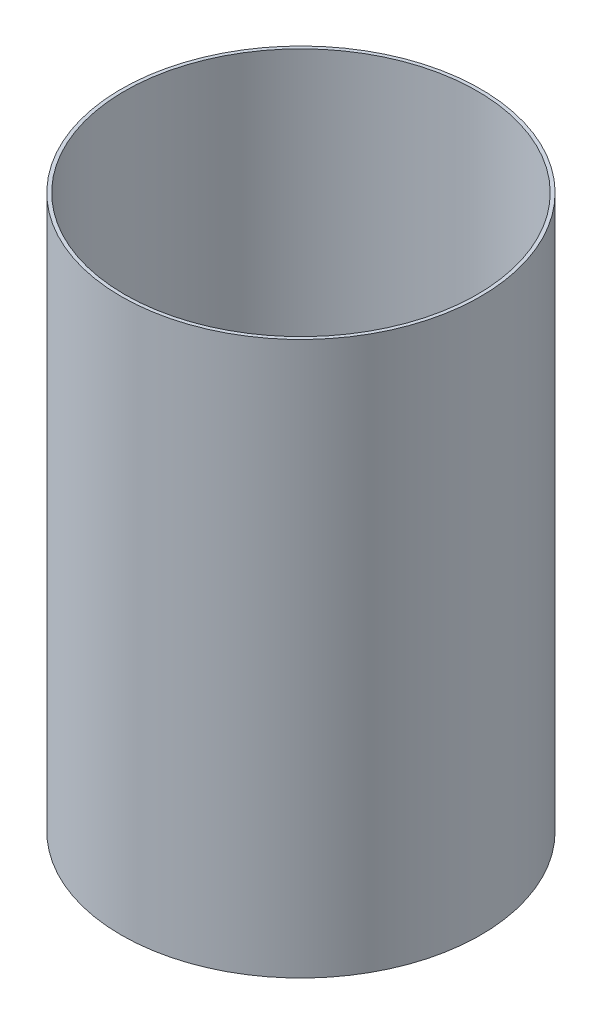
ISO-10303-21;
HEADER;
FILE_DESCRIPTION(('STEP AP214'),'2;1');
FILE_NAME('part.step','',(''),(''),'','','');
FILE_SCHEMA(('AUTOMOTIVE_DESIGN { 1 0 10303 214 1 1 1 1 }'));
ENDSEC;
DATA;
#1=APPLICATION_CONTEXT('core data for automotive mechanical design processes');
#2=APPLICATION_PROTOCOL_DEFINITION('international standard','automotive_design',2000,#1);
#3=PRODUCT_CONTEXT('',#1,'mechanical');
#4=PRODUCT('Part','Part','',(#3));
#5=PRODUCT_RELATED_PRODUCT_CATEGORY('part','',(#4));
#6=PRODUCT_DEFINITION_FORMATION('','',#4);
#7=PRODUCT_DEFINITION_CONTEXT('part definition',#1,'design');
#8=PRODUCT_DEFINITION('design','',#6,#7);
#9=PRODUCT_DEFINITION_SHAPE('','',#8);
#10=(LENGTH_UNIT() NAMED_UNIT(*) SI_UNIT(.MILLI.,.METRE.));
#11=(NAMED_UNIT(*) PLANE_ANGLE_UNIT() SI_UNIT($,.RADIAN.));
#12=(NAMED_UNIT(*) SI_UNIT($,.STERADIAN.) SOLID_ANGLE_UNIT());
#13=UNCERTAINTY_MEASURE_WITH_UNIT(LENGTH_MEASURE(1.E-05),#10,'distance_accuracy_value','');
#14=(GEOMETRIC_REPRESENTATION_CONTEXT(3) GLOBAL_UNCERTAINTY_ASSIGNED_CONTEXT((#13)) GLOBAL_UNIT_ASSIGNED_CONTEXT((#10,
#11,#12)) REPRESENTATION_CONTEXT('',''));
#15=CARTESIAN_POINT('',(0.,0.,0.));
#16=DIRECTION('',(0.,0.,1.));
#17=DIRECTION('',(1.,0.,0.));
#18=AXIS2_PLACEMENT_3D('',#15,#16,#17);
#19=CARTESIAN_POINT('',(0.,203.2,0.));
#20=DIRECTION('',(0.,1.,0.));
#21=DIRECTION('',(0.,0.,1.));
#22=AXIS2_PLACEMENT_3D('',#19,#20,#21);
#23=PLANE('',#22);
#24=CARTESIAN_POINT('',(0.,203.2,0.));
#25=DIRECTION('',(0.,1.,0.));
#26=DIRECTION('',(0.,0.,1.));
#27=AXIS2_PLACEMENT_3D('',#24,#25,#26);
#28=CIRCLE('',#27,66.04);
#29=CARTESIAN_POINT('',(0.,203.2,66.04));
#30=VERTEX_POINT('',#29);
#31=EDGE_CURVE('E10',#30,#30,#28,.T.);
#32=ORIENTED_EDGE('',*,*,#31,.T.);
#33=EDGE_LOOP('',(#32));
#34=FACE_BOUND('',#33,.T.);
#35=CARTESIAN_POINT('',(0.,203.2,0.));
#36=DIRECTION('',(0.,1.,0.));
#37=DIRECTION('',(0.,0.,1.));
#38=AXIS2_PLACEMENT_3D('',#35,#36,#37);
#39=CIRCLE('',#38,64.77);
#40=CARTESIAN_POINT('',(0.,203.2,64.77));
#41=VERTEX_POINT('',#40);
#42=EDGE_CURVE('E42',#41,#41,#39,.T.);
#43=ORIENTED_EDGE('',*,*,#42,.F.);
#44=EDGE_LOOP('',(#43));
#45=FACE_BOUND('',#44,.T.);
#46=ADVANCED_FACE('F31',(#34,#45),#23,.T.);
#47=CARTESIAN_POINT('',(0.,0.,0.));
#48=DIRECTION('',(0.,1.,0.));
#49=DIRECTION('',(0.,0.,1.));
#50=AXIS2_PLACEMENT_3D('',#47,#48,#49);
#51=PLANE('',#50);
#52=CARTESIAN_POINT('',(0.,0.,0.));
#53=DIRECTION('',(0.,1.,0.));
#54=DIRECTION('',(0.,0.,1.));
#55=AXIS2_PLACEMENT_3D('',#52,#53,#54);
#56=CIRCLE('',#55,66.04);
#57=CARTESIAN_POINT('',(0.,0.,66.04));
#58=VERTEX_POINT('',#57);
#59=EDGE_CURVE('E35',#58,#58,#56,.T.);
#60=ORIENTED_EDGE('',*,*,#59,.F.);
#61=EDGE_LOOP('',(#60));
#62=FACE_BOUND('',#61,.T.);
#63=CARTESIAN_POINT('',(0.,0.,0.));
#64=DIRECTION('',(0.,1.,0.));
#65=DIRECTION('',(0.,0.,1.));
#66=AXIS2_PLACEMENT_3D('',#63,#64,#65);
#67=CIRCLE('',#66,64.77);
#68=CARTESIAN_POINT('',(0.,0.,64.77));
#69=VERTEX_POINT('',#68);
#70=EDGE_CURVE('E44',#69,#69,#67,.T.);
#71=ORIENTED_EDGE('',*,*,#70,.T.);
#72=EDGE_LOOP('',(#71));
#73=FACE_BOUND('',#72,.T.);
#74=ADVANCED_FACE('F54',(#62,#73),#51,.F.);
#75=CARTESIAN_POINT('',(0.,203.2,0.));
#76=DIRECTION('',(0.,-1.,0.));
#77=DIRECTION('',(0.,0.,-1.));
#78=AXIS2_PLACEMENT_3D('',#75,#76,#77);
#79=CYLINDRICAL_SURFACE('',#78,66.04);
#80=ORIENTED_EDGE('',*,*,#31,.F.);
#81=EDGE_LOOP('',(#80));
#82=FACE_BOUND('',#81,.T.);
#83=ORIENTED_EDGE('',*,*,#59,.T.);
#84=EDGE_LOOP('',(#83));
#85=FACE_BOUND('',#84,.T.);
#86=ADVANCED_FACE('F33',(#82,#85),#79,.T.);
#87=CARTESIAN_POINT('',(0.,203.2,0.));
#88=DIRECTION('',(0.,-1.,0.));
#89=DIRECTION('',(0.,0.,-1.));
#90=AXIS2_PLACEMENT_3D('',#87,#88,#89);
#91=CYLINDRICAL_SURFACE('',#90,64.77);
#92=ORIENTED_EDGE('',*,*,#42,.T.);
#93=EDGE_LOOP('',(#92));
#94=FACE_BOUND('',#93,.T.);
#95=ORIENTED_EDGE('',*,*,#70,.F.);
#96=EDGE_LOOP('',(#95));
#97=FACE_BOUND('',#96,.T.);
#98=ADVANCED_FACE('F50',(#94,#97),#91,.F.);
#99=CLOSED_SHELL('',(#46,#74,#86,#98));
#100=MANIFOLD_SOLID_BREP('B2',#99);
#101=ADVANCED_BREP_SHAPE_REPRESENTATION('',(#18,#100),#14);
#102=SHAPE_DEFINITION_REPRESENTATION(#9,#101);
ENDSEC;
END-ISO-10303-21;
